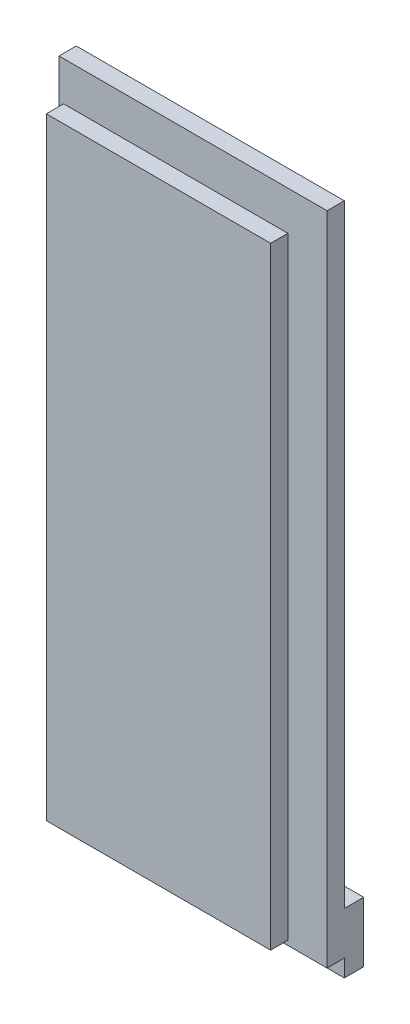
ISO-10303-21;
HEADER;
FILE_DESCRIPTION(('STEP AP214'),'2;1');
FILE_NAME('part.step','',(''),(''),'','','');
FILE_SCHEMA(('AUTOMOTIVE_DESIGN { 1 0 10303 214 1 1 1 1 }'));
ENDSEC;
DATA;
#1=APPLICATION_CONTEXT('core data for automotive mechanical design processes');
#2=APPLICATION_PROTOCOL_DEFINITION('international standard','automotive_design',2000,#1);
#3=PRODUCT_CONTEXT('',#1,'mechanical');
#4=PRODUCT('Part','Part','',(#3));
#5=PRODUCT_RELATED_PRODUCT_CATEGORY('part','',(#4));
#6=PRODUCT_DEFINITION_FORMATION('','',#4);
#7=PRODUCT_DEFINITION_CONTEXT('part definition',#1,'design');
#8=PRODUCT_DEFINITION('design','',#6,#7);
#9=PRODUCT_DEFINITION_SHAPE('','',#8);
#10=(LENGTH_UNIT() NAMED_UNIT(*) SI_UNIT(.MILLI.,.METRE.));
#11=(NAMED_UNIT(*) PLANE_ANGLE_UNIT() SI_UNIT($,.RADIAN.));
#12=(NAMED_UNIT(*) SI_UNIT($,.STERADIAN.) SOLID_ANGLE_UNIT());
#13=UNCERTAINTY_MEASURE_WITH_UNIT(LENGTH_MEASURE(1.E-05),#10,'distance_accuracy_value','');
#14=(GEOMETRIC_REPRESENTATION_CONTEXT(3) GLOBAL_UNCERTAINTY_ASSIGNED_CONTEXT((#13)) GLOBAL_UNIT_ASSIGNED_CONTEXT((#10,
#11,#12)) REPRESENTATION_CONTEXT('',''));
#15=CARTESIAN_POINT('',(0.,0.,0.));
#16=DIRECTION('',(0.,0.,1.));
#17=DIRECTION('',(1.,0.,0.));
#18=AXIS2_PLACEMENT_3D('',#15,#16,#17);
#19=CARTESIAN_POINT('',(-15.5702,-38.1,0.));
#20=DIRECTION('',(0.,0.,1.));
#21=DIRECTION('',(1.,0.,0.));
#22=AXIS2_PLACEMENT_3D('',#19,#20,#21);
#23=PLANE('',#22);
#24=DIRECTION('',(1.,0.,0.));
#25=VECTOR('',#24,1.);
#26=CARTESIAN_POINT('',(15.5702,-33.1,0.));
#27=LINE('',#26,#25);
#28=CARTESIAN_POINT('',(-15.5702,-33.1,0.));
#29=VERTEX_POINT('',#28);
#30=CARTESIAN_POINT('',(15.5702,-33.1,0.));
#31=VERTEX_POINT('',#30);
#32=EDGE_CURVE('E48',#29,#31,#27,.T.);
#33=ORIENTED_EDGE('',*,*,#32,.F.);
#34=DIRECTION('',(0.,-1.,0.));
#35=VECTOR('',#34,1.);
#36=CARTESIAN_POINT('',(-15.5702,38.1,0.));
#37=LINE('',#36,#35);
#38=CARTESIAN_POINT('',(-15.5702,38.1,0.));
#39=VERTEX_POINT('',#38);
#40=EDGE_CURVE('E208',#39,#29,#37,.T.);
#41=ORIENTED_EDGE('',*,*,#40,.F.);
#42=DIRECTION('',(-1.,0.,0.));
#43=VECTOR('',#42,1.);
#44=CARTESIAN_POINT('',(-15.5702,38.1,0.));
#45=LINE('',#44,#43);
#46=CARTESIAN_POINT('',(15.5702,38.1,0.));
#47=VERTEX_POINT('',#46);
#48=EDGE_CURVE('E216',#47,#39,#45,.T.);
#49=ORIENTED_EDGE('',*,*,#48,.F.);
#50=DIRECTION('',(0.,1.,0.));
#51=VECTOR('',#50,1.);
#52=CARTESIAN_POINT('',(15.5702,38.1,0.));
#53=LINE('',#52,#51);
#54=EDGE_CURVE('E195',#31,#47,#53,.T.);
#55=ORIENTED_EDGE('',*,*,#54,.F.);
#56=EDGE_LOOP('',(#33,#41,#49,#55));
#57=FACE_BOUND('',#56,.T.);
#58=ADVANCED_FACE('F31',(#57),#23,.F.);
#59=CARTESIAN_POINT('',(-15.5702,-38.1,2.0066));
#60=DIRECTION('',(0.,0.,1.));
#61=DIRECTION('',(1.,0.,0.));
#62=AXIS2_PLACEMENT_3D('',#59,#60,#61);
#63=PLANE('',#62);
#64=DIRECTION('',(0.,-1.,0.));
#65=VECTOR('',#64,1.);
#66=CARTESIAN_POINT('',(-15.5702,38.1,2.0066));
#67=LINE('',#66,#65);
#68=CARTESIAN_POINT('',(-15.5702,38.1,2.0066));
#69=VERTEX_POINT('',#68);
#70=CARTESIAN_POINT('',(-15.5702,-38.1,2.0066));
#71=VERTEX_POINT('',#70);
#72=EDGE_CURVE('E218',#69,#71,#67,.T.);
#73=ORIENTED_EDGE('',*,*,#72,.T.);
#74=DIRECTION('',(1.,0.,0.));
#75=VECTOR('',#74,1.);
#76=CARTESIAN_POINT('',(-15.5702,-38.1,2.0066));
#77=LINE('',#76,#75);
#78=CARTESIAN_POINT('',(15.5702,-38.1,2.0066));
#79=VERTEX_POINT('',#78);
#80=EDGE_CURVE('E239',#71,#79,#77,.T.);
#81=ORIENTED_EDGE('',*,*,#80,.T.);
#82=DIRECTION('',(0.,1.,0.));
#83=VECTOR('',#82,1.);
#84=CARTESIAN_POINT('',(15.5702,38.1,2.0066));
#85=LINE('',#84,#83);
#86=CARTESIAN_POINT('',(15.5702,38.1,2.0066));
#87=VERTEX_POINT('',#86);
#88=EDGE_CURVE('E241',#79,#87,#85,.T.);
#89=ORIENTED_EDGE('',*,*,#88,.T.);
#90=DIRECTION('',(-1.,0.,0.));
#91=VECTOR('',#90,1.);
#92=CARTESIAN_POINT('',(-15.5702,38.1,2.0066));
#93=LINE('',#92,#91);
#94=EDGE_CURVE('E223',#87,#69,#93,.T.);
#95=ORIENTED_EDGE('',*,*,#94,.T.);
#96=EDGE_LOOP('',(#73,#81,#89,#95));
#97=FACE_BOUND('',#96,.T.);
#98=DIRECTION('',(1.,0.,0.));
#99=VECTOR('',#98,1.);
#100=CARTESIAN_POINT('',(-11.0236,-33.5534,2.0066));
#101=LINE('',#100,#99);
#102=CARTESIAN_POINT('',(-11.0236,-33.5534,2.0066));
#103=VERTEX_POINT('',#102);
#104=CARTESIAN_POINT('',(11.0236,-33.5534,2.0066));
#105=VERTEX_POINT('',#104);
#106=EDGE_CURVE('E463',#103,#105,#101,.T.);
#107=ORIENTED_EDGE('',*,*,#106,.F.);
#108=DIRECTION('',(0.,-1.,0.));
#109=VECTOR('',#108,1.);
#110=CARTESIAN_POINT('',(-11.0236,33.5534,2.0066));
#111=LINE('',#110,#109);
#112=CARTESIAN_POINT('',(-11.0236,33.5534,2.0066));
#113=VERTEX_POINT('',#112);
#114=EDGE_CURVE('E460',#113,#103,#111,.T.);
#115=ORIENTED_EDGE('',*,*,#114,.F.);
#116=DIRECTION('',(-1.,0.,0.));
#117=VECTOR('',#116,1.);
#118=CARTESIAN_POINT('',(-11.0236,33.5534,2.0066));
#119=LINE('',#118,#117);
#120=CARTESIAN_POINT('',(11.0236,33.5534,2.0066));
#121=VERTEX_POINT('',#120);
#122=EDGE_CURVE('E474',#121,#113,#119,.T.);
#123=ORIENTED_EDGE('',*,*,#122,.F.);
#124=DIRECTION('',(0.,1.,0.));
#125=VECTOR('',#124,1.);
#126=CARTESIAN_POINT('',(11.0236,33.5534,2.0066));
#127=LINE('',#126,#125);
#128=EDGE_CURVE('E485',#105,#121,#127,.T.);
#129=ORIENTED_EDGE('',*,*,#128,.F.);
#130=EDGE_LOOP('',(#107,#115,#123,#129));
#131=FACE_BOUND('',#130,.T.);
#132=ADVANCED_FACE('F245',(#97,#131),#63,.T.);
#133=CARTESIAN_POINT('',(-15.5702,38.1,2.0066));
#134=DIRECTION('',(1.,0.,0.));
#135=DIRECTION('',(0.,1.,0.));
#136=AXIS2_PLACEMENT_3D('',#133,#134,#135);
#137=PLANE('',#136);
#138=ORIENTED_EDGE('',*,*,#40,.T.);
#139=DIRECTION('',(0.,0.,1.));
#140=VECTOR('',#139,1.);
#141=CARTESIAN_POINT('',(-15.5702,-33.1,-2.25));
#142=LINE('',#141,#140);
#143=CARTESIAN_POINT('',(-15.5702,-33.1,-2.25));
#144=VERTEX_POINT('',#143);
#145=EDGE_CURVE('E176',#144,#29,#142,.T.);
#146=ORIENTED_EDGE('',*,*,#145,.F.);
#147=DIRECTION('',(0.,1.,0.));
#148=VECTOR('',#147,1.);
#149=CARTESIAN_POINT('',(-15.5702,-33.1,-2.25));
#150=LINE('',#149,#148);
#151=CARTESIAN_POINT('',(-15.5702,-40.1,-2.25));
#152=VERTEX_POINT('',#151);
#153=EDGE_CURVE('E155',#152,#144,#150,.T.);
#154=ORIENTED_EDGE('',*,*,#153,.F.);
#155=DIRECTION('',(0.,0.,1.));
#156=VECTOR('',#155,1.);
#157=CARTESIAN_POINT('',(-15.5702,-40.1,-2.25));
#158=LINE('',#157,#156);
#159=CARTESIAN_POINT('',(-15.5702,-40.1,0.));
#160=VERTEX_POINT('',#159);
#161=EDGE_CURVE('E152',#152,#160,#158,.T.);
#162=ORIENTED_EDGE('',*,*,#161,.T.);
#163=DIRECTION('',(0.,1.,0.));
#164=VECTOR('',#163,1.);
#165=CARTESIAN_POINT('',(-15.5702,-33.1,0.));
#166=LINE('',#165,#164);
#167=CARTESIAN_POINT('',(-15.5702,-38.1,0.));
#168=VERTEX_POINT('',#167);
#169=EDGE_CURVE('E183',#160,#168,#166,.T.);
#170=ORIENTED_EDGE('',*,*,#169,.T.);
#171=DIRECTION('',(0.,0.,-1.));
#172=VECTOR('',#171,1.);
#173=CARTESIAN_POINT('',(-15.5702,-38.1,2.0066));
#174=LINE('',#173,#172);
#175=EDGE_CURVE('E11',#71,#168,#174,.T.);
#176=ORIENTED_EDGE('',*,*,#175,.F.);
#177=ORIENTED_EDGE('',*,*,#72,.F.);
#178=DIRECTION('',(0.,0.,-1.));
#179=VECTOR('',#178,1.);
#180=CARTESIAN_POINT('',(-15.5702,38.1,2.0066));
#181=LINE('',#180,#179);
#182=EDGE_CURVE('E219',#69,#39,#181,.T.);
#183=ORIENTED_EDGE('',*,*,#182,.T.);
#184=EDGE_LOOP('',(#138,#146,#154,#162,#170,#176,#177,#183));
#185=FACE_BOUND('',#184,.T.);
#186=ADVANCED_FACE('F33',(#185),#137,.F.);
#187=CARTESIAN_POINT('',(-15.5702,-38.1,2.0066));
#188=DIRECTION('',(0.,1.,0.));
#189=DIRECTION('',(-1.,0.,0.));
#190=AXIS2_PLACEMENT_3D('',#187,#188,#189);
#191=PLANE('',#190);
#192=DIRECTION('',(1.,0.,0.));
#193=VECTOR('',#192,1.);
#194=CARTESIAN_POINT('',(-15.5702,-38.1,0.));
#195=LINE('',#194,#193);
#196=CARTESIAN_POINT('',(15.5702,-38.1,0.));
#197=VERTEX_POINT('',#196);
#198=EDGE_CURVE('E206',#168,#197,#195,.T.);
#199=ORIENTED_EDGE('',*,*,#198,.T.);
#200=DIRECTION('',(0.,0.,-1.));
#201=VECTOR('',#200,1.);
#202=CARTESIAN_POINT('',(15.5702,-38.1,2.0066));
#203=LINE('',#202,#201);
#204=EDGE_CURVE('E40',#79,#197,#203,.T.);
#205=ORIENTED_EDGE('',*,*,#204,.F.);
#206=ORIENTED_EDGE('',*,*,#80,.F.);
#207=ORIENTED_EDGE('',*,*,#175,.T.);
#208=EDGE_LOOP('',(#199,#205,#206,#207));
#209=FACE_BOUND('',#208,.T.);
#210=ADVANCED_FACE('F258',(#209),#191,.F.);
#211=CARTESIAN_POINT('',(15.5702,38.1,2.0066));
#212=DIRECTION('',(-1.,0.,0.));
#213=DIRECTION('',(0.,-1.,0.));
#214=AXIS2_PLACEMENT_3D('',#211,#212,#213);
#215=PLANE('',#214);
#216=ORIENTED_EDGE('',*,*,#204,.T.);
#217=DIRECTION('',(0.,-1.,0.));
#218=VECTOR('',#217,1.);
#219=CARTESIAN_POINT('',(15.5702,-33.1,0.));
#220=LINE('',#219,#218);
#221=CARTESIAN_POINT('',(15.5702,-40.1,0.));
#222=VERTEX_POINT('',#221);
#223=EDGE_CURVE('E169',#197,#222,#220,.T.);
#224=ORIENTED_EDGE('',*,*,#223,.T.);
#225=DIRECTION('',(0.,0.,1.));
#226=VECTOR('',#225,1.);
#227=CARTESIAN_POINT('',(15.5702,-40.1,-2.25));
#228=LINE('',#227,#226);
#229=CARTESIAN_POINT('',(15.5702,-40.1,-2.25));
#230=VERTEX_POINT('',#229);
#231=EDGE_CURVE('E150',#230,#222,#228,.T.);
#232=ORIENTED_EDGE('',*,*,#231,.F.);
#233=DIRECTION('',(0.,-1.,0.));
#234=VECTOR('',#233,1.);
#235=CARTESIAN_POINT('',(15.5702,-33.1,-2.25));
#236=LINE('',#235,#234);
#237=CARTESIAN_POINT('',(15.5702,-33.1,-2.25));
#238=VERTEX_POINT('',#237);
#239=EDGE_CURVE('E156',#238,#230,#236,.T.);
#240=ORIENTED_EDGE('',*,*,#239,.F.);
#241=DIRECTION('',(0.,0.,1.));
#242=VECTOR('',#241,1.);
#243=CARTESIAN_POINT('',(15.5702,-33.1,-2.25));
#244=LINE('',#243,#242);
#245=EDGE_CURVE('E198',#238,#31,#244,.T.);
#246=ORIENTED_EDGE('',*,*,#245,.T.);
#247=ORIENTED_EDGE('',*,*,#54,.T.);
#248=DIRECTION('',(0.,0.,-1.));
#249=VECTOR('',#248,1.);
#250=CARTESIAN_POINT('',(15.5702,38.1,2.0066));
#251=LINE('',#250,#249);
#252=EDGE_CURVE('E222',#87,#47,#251,.T.);
#253=ORIENTED_EDGE('',*,*,#252,.F.);
#254=ORIENTED_EDGE('',*,*,#88,.F.);
#255=EDGE_LOOP('',(#216,#224,#232,#240,#246,#247,#253,#254));
#256=FACE_BOUND('',#255,.T.);
#257=ADVANCED_FACE('F167',(#256),#215,.F.);
#258=CARTESIAN_POINT('',(-15.5702,38.1,2.0066));
#259=DIRECTION('',(0.,-1.,0.));
#260=DIRECTION('',(0.,0.,-1.));
#261=AXIS2_PLACEMENT_3D('',#258,#259,#260);
#262=PLANE('',#261);
#263=ORIENTED_EDGE('',*,*,#48,.T.);
#264=ORIENTED_EDGE('',*,*,#182,.F.);
#265=ORIENTED_EDGE('',*,*,#94,.F.);
#266=ORIENTED_EDGE('',*,*,#252,.T.);
#267=EDGE_LOOP('',(#263,#264,#265,#266));
#268=FACE_BOUND('',#267,.T.);
#269=ADVANCED_FACE('F252',(#268),#262,.F.);
#270=CARTESIAN_POINT('',(-11.0236,33.5534,4.0132));
#271=DIRECTION('',(1.,0.,0.));
#272=DIRECTION('',(0.,0.,-1.));
#273=AXIS2_PLACEMENT_3D('',#270,#271,#272);
#274=PLANE('',#273);
#275=ORIENTED_EDGE('',*,*,#114,.T.);
#276=DIRECTION('',(0.,0.,-1.));
#277=VECTOR('',#276,1.);
#278=CARTESIAN_POINT('',(-11.0236,-33.5534,4.0132));
#279=LINE('',#278,#277);
#280=CARTESIAN_POINT('',(-11.0236,-33.5534,4.0132));
#281=VERTEX_POINT('',#280);
#282=EDGE_CURVE('E225',#281,#103,#279,.T.);
#283=ORIENTED_EDGE('',*,*,#282,.F.);
#284=DIRECTION('',(0.,-1.,0.));
#285=VECTOR('',#284,1.);
#286=CARTESIAN_POINT('',(-11.0236,33.5534,4.0132));
#287=LINE('',#286,#285);
#288=CARTESIAN_POINT('',(-11.0236,33.5534,4.0132));
#289=VERTEX_POINT('',#288);
#290=EDGE_CURVE('E470',#289,#281,#287,.T.);
#291=ORIENTED_EDGE('',*,*,#290,.F.);
#292=DIRECTION('',(0.,0.,-1.));
#293=VECTOR('',#292,1.);
#294=CARTESIAN_POINT('',(-11.0236,33.5534,4.0132));
#295=LINE('',#294,#293);
#296=EDGE_CURVE('E482',#289,#113,#295,.T.);
#297=ORIENTED_EDGE('',*,*,#296,.T.);
#298=EDGE_LOOP('',(#275,#283,#291,#297));
#299=FACE_BOUND('',#298,.T.);
#300=ADVANCED_FACE('F274',(#299),#274,.F.);
#301=CARTESIAN_POINT('',(-11.0236,-33.5534,4.0132));
#302=DIRECTION('',(0.,1.,0.));
#303=DIRECTION('',(-1.,0.,0.));
#304=AXIS2_PLACEMENT_3D('',#301,#302,#303);
#305=PLANE('',#304);
#306=ORIENTED_EDGE('',*,*,#106,.T.);
#307=DIRECTION('',(0.,0.,-1.));
#308=VECTOR('',#307,1.);
#309=CARTESIAN_POINT('',(11.0236,-33.5534,4.0132));
#310=LINE('',#309,#308);
#311=CARTESIAN_POINT('',(11.0236,-33.5534,4.0132));
#312=VERTEX_POINT('',#311);
#313=EDGE_CURVE('E228',#312,#105,#310,.T.);
#314=ORIENTED_EDGE('',*,*,#313,.F.);
#315=DIRECTION('',(1.,0.,0.));
#316=VECTOR('',#315,1.);
#317=CARTESIAN_POINT('',(-11.0236,-33.5534,4.0132));
#318=LINE('',#317,#316);
#319=EDGE_CURVE('E473',#281,#312,#318,.T.);
#320=ORIENTED_EDGE('',*,*,#319,.F.);
#321=ORIENTED_EDGE('',*,*,#282,.T.);
#322=EDGE_LOOP('',(#306,#314,#320,#321));
#323=FACE_BOUND('',#322,.T.);
#324=ADVANCED_FACE('F298',(#323),#305,.F.);
#325=CARTESIAN_POINT('',(11.0236,33.5534,4.0132));
#326=DIRECTION('',(-1.,0.,0.));
#327=DIRECTION('',(0.,0.,1.));
#328=AXIS2_PLACEMENT_3D('',#325,#326,#327);
#329=PLANE('',#328);
#330=ORIENTED_EDGE('',*,*,#128,.T.);
#331=DIRECTION('',(0.,0.,-1.));
#332=VECTOR('',#331,1.);
#333=CARTESIAN_POINT('',(11.0236,33.5534,4.0132));
#334=LINE('',#333,#332);
#335=CARTESIAN_POINT('',(11.0236,33.5534,4.0132));
#336=VERTEX_POINT('',#335);
#337=EDGE_CURVE('E56',#336,#121,#334,.T.);
#338=ORIENTED_EDGE('',*,*,#337,.F.);
#339=DIRECTION('',(0.,1.,0.));
#340=VECTOR('',#339,1.);
#341=CARTESIAN_POINT('',(11.0236,33.5534,4.0132));
#342=LINE('',#341,#340);
#343=EDGE_CURVE('E477',#312,#336,#342,.T.);
#344=ORIENTED_EDGE('',*,*,#343,.F.);
#345=ORIENTED_EDGE('',*,*,#313,.T.);
#346=EDGE_LOOP('',(#330,#338,#344,#345));
#347=FACE_BOUND('',#346,.T.);
#348=ADVANCED_FACE('F307',(#347),#329,.F.);
#349=CARTESIAN_POINT('',(-11.0236,33.5534,4.0132));
#350=DIRECTION('',(0.,-1.,0.));
#351=DIRECTION('',(1.,0.,0.));
#352=AXIS2_PLACEMENT_3D('',#349,#350,#351);
#353=PLANE('',#352);
#354=ORIENTED_EDGE('',*,*,#122,.T.);
#355=ORIENTED_EDGE('',*,*,#296,.F.);
#356=DIRECTION('',(-1.,0.,0.));
#357=VECTOR('',#356,1.);
#358=CARTESIAN_POINT('',(-11.0236,33.5534,4.0132));
#359=LINE('',#358,#357);
#360=EDGE_CURVE('E480',#336,#289,#359,.T.);
#361=ORIENTED_EDGE('',*,*,#360,.F.);
#362=ORIENTED_EDGE('',*,*,#337,.T.);
#363=EDGE_LOOP('',(#354,#355,#361,#362));
#364=FACE_BOUND('',#363,.T.);
#365=ADVANCED_FACE('F316',(#364),#353,.F.);
#366=CARTESIAN_POINT('',(-13.0302,-35.56,4.0132));
#367=DIRECTION('',(0.,0.,1.));
#368=DIRECTION('',(1.,0.,0.));
#369=AXIS2_PLACEMENT_3D('',#366,#367,#368);
#370=PLANE('',#369);
#371=DIRECTION('',(0.,-1.,0.));
#372=VECTOR('',#371,1.);
#373=CARTESIAN_POINT('',(-13.0302,35.56,4.0132));
#374=LINE('',#373,#372);
#375=CARTESIAN_POINT('',(-13.0302,35.56,4.0132));
#376=VERTEX_POINT('',#375);
#377=CARTESIAN_POINT('',(-13.0302,-35.56,4.0132));
#378=VERTEX_POINT('',#377);
#379=EDGE_CURVE('E171',#376,#378,#374,.T.);
#380=ORIENTED_EDGE('',*,*,#379,.F.);
#381=DIRECTION('',(-1.,0.,0.));
#382=VECTOR('',#381,1.);
#383=CARTESIAN_POINT('',(-13.0302,35.56,4.0132));
#384=LINE('',#383,#382);
#385=CARTESIAN_POINT('',(13.0302,35.56,4.0132));
#386=VERTEX_POINT('',#385);
#387=EDGE_CURVE('E456',#386,#376,#384,.T.);
#388=ORIENTED_EDGE('',*,*,#387,.F.);
#389=DIRECTION('',(0.,1.,0.));
#390=VECTOR('',#389,1.);
#391=CARTESIAN_POINT('',(13.0302,35.56,4.0132));
#392=LINE('',#391,#390);
#393=CARTESIAN_POINT('',(13.0302,-35.56,4.0132));
#394=VERTEX_POINT('',#393);
#395=EDGE_CURVE('E501',#394,#386,#392,.T.);
#396=ORIENTED_EDGE('',*,*,#395,.F.);
#397=DIRECTION('',(1.,0.,0.));
#398=VECTOR('',#397,1.);
#399=CARTESIAN_POINT('',(-13.0302,-35.56,4.0132));
#400=LINE('',#399,#398);
#401=EDGE_CURVE('E174',#378,#394,#400,.T.);
#402=ORIENTED_EDGE('',*,*,#401,.F.);
#403=EDGE_LOOP('',(#380,#388,#396,#402));
#404=FACE_BOUND('',#403,.T.);
#405=ORIENTED_EDGE('',*,*,#360,.T.);
#406=ORIENTED_EDGE('',*,*,#290,.T.);
#407=ORIENTED_EDGE('',*,*,#319,.T.);
#408=ORIENTED_EDGE('',*,*,#343,.T.);
#409=EDGE_LOOP('',(#405,#406,#407,#408));
#410=FACE_BOUND('',#409,.T.);
#411=ADVANCED_FACE('F326',(#404,#410),#370,.F.);
#412=CARTESIAN_POINT('',(-13.0302,35.56,6.0198));
#413=DIRECTION('',(1.,0.,0.));
#414=DIRECTION('',(0.,1.,0.));
#415=AXIS2_PLACEMENT_3D('',#412,#413,#414);
#416=PLANE('',#415);
#417=ORIENTED_EDGE('',*,*,#379,.T.);
#418=DIRECTION('',(0.,0.,-1.));
#419=VECTOR('',#418,1.);
#420=CARTESIAN_POINT('',(-13.0302,-35.56,6.0198));
#421=LINE('',#420,#419);
#422=CARTESIAN_POINT('',(-13.0302,-35.56,6.0198));
#423=VERTEX_POINT('',#422);
#424=EDGE_CURVE('E458',#423,#378,#421,.T.);
#425=ORIENTED_EDGE('',*,*,#424,.F.);
#426=DIRECTION('',(0.,-1.,0.));
#427=VECTOR('',#426,1.);
#428=CARTESIAN_POINT('',(-13.0302,35.56,6.0198));
#429=LINE('',#428,#427);
#430=CARTESIAN_POINT('',(-13.0302,35.56,6.0198));
#431=VERTEX_POINT('',#430);
#432=EDGE_CURVE('E448',#431,#423,#429,.T.);
#433=ORIENTED_EDGE('',*,*,#432,.F.);
#434=DIRECTION('',(0.,0.,-1.));
#435=VECTOR('',#434,1.);
#436=CARTESIAN_POINT('',(-13.0302,35.56,6.0198));
#437=LINE('',#436,#435);
#438=EDGE_CURVE('E498',#431,#376,#437,.T.);
#439=ORIENTED_EDGE('',*,*,#438,.T.);
#440=EDGE_LOOP('',(#417,#425,#433,#439));
#441=FACE_BOUND('',#440,.T.);
#442=ADVANCED_FACE('F335',(#441),#416,.F.);
#443=CARTESIAN_POINT('',(-13.0302,-35.56,6.0198));
#444=DIRECTION('',(0.,1.,0.));
#445=DIRECTION('',(0.,0.,1.));
#446=AXIS2_PLACEMENT_3D('',#443,#444,#445);
#447=PLANE('',#446);
#448=ORIENTED_EDGE('',*,*,#401,.T.);
#449=DIRECTION('',(0.,0.,-1.));
#450=VECTOR('',#449,1.);
#451=CARTESIAN_POINT('',(13.0302,-35.56,6.0198));
#452=LINE('',#451,#450);
#453=CARTESIAN_POINT('',(13.0302,-35.56,6.0198));
#454=VERTEX_POINT('',#453);
#455=EDGE_CURVE('E461',#454,#394,#452,.T.);
#456=ORIENTED_EDGE('',*,*,#455,.F.);
#457=DIRECTION('',(1.,0.,0.));
#458=VECTOR('',#457,1.);
#459=CARTESIAN_POINT('',(-13.0302,-35.56,6.0198));
#460=LINE('',#459,#458);
#461=EDGE_CURVE('E450',#423,#454,#460,.T.);
#462=ORIENTED_EDGE('',*,*,#461,.F.);
#463=ORIENTED_EDGE('',*,*,#424,.T.);
#464=EDGE_LOOP('',(#448,#456,#462,#463));
#465=FACE_BOUND('',#464,.T.);
#466=ADVANCED_FACE('F345',(#465),#447,.F.);
#467=CARTESIAN_POINT('',(13.0302,35.56,6.0198));
#468=DIRECTION('',(-1.,0.,0.));
#469=DIRECTION('',(0.,-1.,0.));
#470=AXIS2_PLACEMENT_3D('',#467,#468,#469);
#471=PLANE('',#470);
#472=ORIENTED_EDGE('',*,*,#395,.T.);
#473=DIRECTION('',(0.,0.,-1.));
#474=VECTOR('',#473,1.);
#475=CARTESIAN_POINT('',(13.0302,35.56,6.0198));
#476=LINE('',#475,#474);
#477=CARTESIAN_POINT('',(13.0302,35.56,6.0198));
#478=VERTEX_POINT('',#477);
#479=EDGE_CURVE('E466',#478,#386,#476,.T.);
#480=ORIENTED_EDGE('',*,*,#479,.F.);
#481=DIRECTION('',(0.,1.,0.));
#482=VECTOR('',#481,1.);
#483=CARTESIAN_POINT('',(13.0302,35.56,6.0198));
#484=LINE('',#483,#482);
#485=EDGE_CURVE('E505',#454,#478,#484,.T.);
#486=ORIENTED_EDGE('',*,*,#485,.F.);
#487=ORIENTED_EDGE('',*,*,#455,.T.);
#488=EDGE_LOOP('',(#472,#480,#486,#487));
#489=FACE_BOUND('',#488,.T.);
#490=ADVANCED_FACE('F355',(#489),#471,.F.);
#491=CARTESIAN_POINT('',(-13.0302,35.56,6.0198));
#492=DIRECTION('',(0.,-1.,0.));
#493=DIRECTION('',(0.,0.,-1.));
#494=AXIS2_PLACEMENT_3D('',#491,#492,#493);
#495=PLANE('',#494);
#496=ORIENTED_EDGE('',*,*,#387,.T.);
#497=ORIENTED_EDGE('',*,*,#438,.F.);
#498=DIRECTION('',(-1.,0.,0.));
#499=VECTOR('',#498,1.);
#500=CARTESIAN_POINT('',(-13.0302,35.56,6.0198));
#501=LINE('',#500,#499);
#502=EDGE_CURVE('E453',#478,#431,#501,.T.);
#503=ORIENTED_EDGE('',*,*,#502,.F.);
#504=ORIENTED_EDGE('',*,*,#479,.T.);
#505=EDGE_LOOP('',(#496,#497,#503,#504));
#506=FACE_BOUND('',#505,.T.);
#507=ADVANCED_FACE('F365',(#506),#495,.F.);
#508=CARTESIAN_POINT('',(-13.0302,-35.56,6.0198));
#509=DIRECTION('',(0.,0.,1.));
#510=DIRECTION('',(1.,0.,0.));
#511=AXIS2_PLACEMENT_3D('',#508,#509,#510);
#512=PLANE('',#511);
#513=ORIENTED_EDGE('',*,*,#432,.T.);
#514=ORIENTED_EDGE('',*,*,#461,.T.);
#515=ORIENTED_EDGE('',*,*,#485,.T.);
#516=ORIENTED_EDGE('',*,*,#502,.T.);
#517=EDGE_LOOP('',(#513,#514,#515,#516));
#518=FACE_BOUND('',#517,.T.);
#519=ADVANCED_FACE('F375',(#518),#512,.T.);
#520=CARTESIAN_POINT('',(15.5702,-40.1,-2.25));
#521=DIRECTION('',(0.,1.,0.));
#522=DIRECTION('',(0.,0.,1.));
#523=AXIS2_PLACEMENT_3D('',#520,#521,#522);
#524=PLANE('',#523);
#525=DIRECTION('',(-1.,0.,0.));
#526=VECTOR('',#525,1.);
#527=CARTESIAN_POINT('',(15.5702,-40.1,0.));
#528=LINE('',#527,#526);
#529=EDGE_CURVE('E182',#222,#160,#528,.T.);
#530=ORIENTED_EDGE('',*,*,#529,.T.);
#531=ORIENTED_EDGE('',*,*,#161,.F.);
#532=DIRECTION('',(-1.,0.,0.));
#533=VECTOR('',#532,1.);
#534=CARTESIAN_POINT('',(15.5702,-40.1,-2.25));
#535=LINE('',#534,#533);
#536=EDGE_CURVE('E146',#230,#152,#535,.T.);
#537=ORIENTED_EDGE('',*,*,#536,.F.);
#538=ORIENTED_EDGE('',*,*,#231,.T.);
#539=EDGE_LOOP('',(#530,#531,#537,#538));
#540=FACE_BOUND('',#539,.T.);
#541=ADVANCED_FACE('F148',(#540),#524,.F.);
#542=CARTESIAN_POINT('',(15.5702,-33.1,-2.25));
#543=DIRECTION('',(0.,-1.,0.));
#544=DIRECTION('',(0.,0.,-1.));
#545=AXIS2_PLACEMENT_3D('',#542,#543,#544);
#546=PLANE('',#545);
#547=ORIENTED_EDGE('',*,*,#32,.T.);
#548=ORIENTED_EDGE('',*,*,#245,.F.);
#549=DIRECTION('',(1.,0.,0.));
#550=VECTOR('',#549,1.);
#551=CARTESIAN_POINT('',(15.5702,-33.1,-2.25));
#552=LINE('',#551,#550);
#553=EDGE_CURVE('E161',#144,#238,#552,.T.);
#554=ORIENTED_EDGE('',*,*,#553,.F.);
#555=ORIENTED_EDGE('',*,*,#145,.T.);
#556=EDGE_LOOP('',(#547,#548,#554,#555));
#557=FACE_BOUND('',#556,.T.);
#558=ADVANCED_FACE('F263',(#557),#546,.F.);
#559=CARTESIAN_POINT('',(15.5702,-40.1,-2.25));
#560=DIRECTION('',(0.,0.,-1.));
#561=DIRECTION('',(-1.,0.,0.));
#562=AXIS2_PLACEMENT_3D('',#559,#560,#561);
#563=PLANE('',#562);
#564=ORIENTED_EDGE('',*,*,#239,.T.);
#565=ORIENTED_EDGE('',*,*,#536,.T.);
#566=ORIENTED_EDGE('',*,*,#153,.T.);
#567=ORIENTED_EDGE('',*,*,#553,.T.);
#568=EDGE_LOOP('',(#564,#565,#566,#567));
#569=FACE_BOUND('',#568,.T.);
#570=ADVANCED_FACE('F159',(#569),#563,.T.);
#571=CARTESIAN_POINT('',(15.5702,-40.1,0.));
#572=DIRECTION('',(0.,0.,-1.));
#573=DIRECTION('',(-1.,0.,0.));
#574=AXIS2_PLACEMENT_3D('',#571,#572,#573);
#575=PLANE('',#574);
#576=ORIENTED_EDGE('',*,*,#198,.F.);
#577=ORIENTED_EDGE('',*,*,#169,.F.);
#578=ORIENTED_EDGE('',*,*,#529,.F.);
#579=ORIENTED_EDGE('',*,*,#223,.F.);
#580=EDGE_LOOP('',(#576,#577,#578,#579));
#581=FACE_BOUND('',#580,.T.);
#582=ADVANCED_FACE('F261',(#581),#575,.F.);
#583=CLOSED_SHELL('',(#58,#132,#186,#210,#257,#269,#300,#324,#348,#365,#411,#442,#466,#490,#507,
#519,#541,#558,#570,#582));
#584=MANIFOLD_SOLID_BREP('B2',#583);
#585=ADVANCED_BREP_SHAPE_REPRESENTATION('',(#18,#584),#14);
#586=SHAPE_DEFINITION_REPRESENTATION(#9,#585);
ENDSEC;
END-ISO-10303-21;
